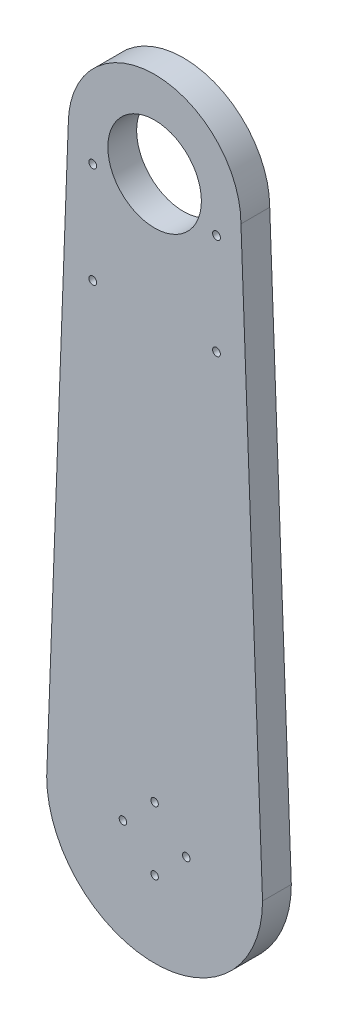
ISO-10303-21;
HEADER;
FILE_DESCRIPTION(('STEP AP214'),'2;1');
FILE_NAME('part.step','',(''),(''),'','','');
FILE_SCHEMA(('AUTOMOTIVE_DESIGN { 1 0 10303 214 1 1 1 1 }'));
ENDSEC;
DATA;
#1=APPLICATION_CONTEXT('core data for automotive mechanical design processes');
#2=APPLICATION_PROTOCOL_DEFINITION('international standard','automotive_design',2000,#1);
#3=PRODUCT_CONTEXT('',#1,'mechanical');
#4=PRODUCT('Part','Part','',(#3));
#5=PRODUCT_RELATED_PRODUCT_CATEGORY('part','',(#4));
#6=PRODUCT_DEFINITION_FORMATION('','',#4);
#7=PRODUCT_DEFINITION_CONTEXT('part definition',#1,'design');
#8=PRODUCT_DEFINITION('design','',#6,#7);
#9=PRODUCT_DEFINITION_SHAPE('','',#8);
#10=(LENGTH_UNIT() NAMED_UNIT(*) SI_UNIT(.MILLI.,.METRE.));
#11=(NAMED_UNIT(*) PLANE_ANGLE_UNIT() SI_UNIT($,.RADIAN.));
#12=(NAMED_UNIT(*) SI_UNIT($,.STERADIAN.) SOLID_ANGLE_UNIT());
#13=UNCERTAINTY_MEASURE_WITH_UNIT(LENGTH_MEASURE(1.E-05),#10,'distance_accuracy_value','');
#14=(GEOMETRIC_REPRESENTATION_CONTEXT(3) GLOBAL_UNCERTAINTY_ASSIGNED_CONTEXT((#13)) GLOBAL_UNIT_ASSIGNED_CONTEXT((#10,
#11,#12)) REPRESENTATION_CONTEXT('',''));
#15=CARTESIAN_POINT('',(0.,0.,0.));
#16=DIRECTION('',(0.,0.,1.));
#17=DIRECTION('',(1.,0.,0.));
#18=AXIS2_PLACEMENT_3D('',#15,#16,#17);
#19=CARTESIAN_POINT('',(37.447339678577,1.40427523794664,10.));
#20=DIRECTION('',(0.999297615709181,0.0374736605890943,0.));
#21=DIRECTION('',(-0.0374736605890943,0.999297615709181,0.));
#22=AXIS2_PLACEMENT_3D('',#19,#20,#21);
#23=PLANE('',#22);
#24=DIRECTION('',(0.0374736605890943,-0.999297615709181,0.));
#25=VECTOR('',#24,1.);
#26=CARTESIAN_POINT('',(37.447339678577,1.40427523794664,0.));
#27=LINE('',#26,#25);
#28=CARTESIAN_POINT('',(30.,200.,0.));
#29=VERTEX_POINT('',#28);
#30=CARTESIAN_POINT('',(37.5,0.,0.));
#31=VERTEX_POINT('',#30);
#32=EDGE_CURVE('E111',#29,#31,#27,.T.);
#33=ORIENTED_EDGE('',*,*,#32,.F.);
#34=DIRECTION('',(0.,0.,-1.));
#35=VECTOR('',#34,1.);
#36=CARTESIAN_POINT('',(30.,200.,10.));
#37=LINE('',#36,#35);
#38=CARTESIAN_POINT('',(30.,200.,10.));
#39=VERTEX_POINT('',#38);
#40=EDGE_CURVE('E11',#39,#29,#37,.T.);
#41=ORIENTED_EDGE('',*,*,#40,.F.);
#42=DIRECTION('',(0.0374736605890943,-0.999297615709181,0.));
#43=VECTOR('',#42,1.);
#44=CARTESIAN_POINT('',(37.447339678577,1.40427523794664,10.));
#45=LINE('',#44,#43);
#46=CARTESIAN_POINT('',(37.5,0.,10.));
#47=VERTEX_POINT('',#46);
#48=EDGE_CURVE('E95',#39,#47,#45,.T.);
#49=ORIENTED_EDGE('',*,*,#48,.T.);
#50=DIRECTION('',(0.,0.,-1.));
#51=VECTOR('',#50,1.);
#52=CARTESIAN_POINT('',(37.5,0.,10.));
#53=LINE('',#52,#51);
#54=EDGE_CURVE('E84',#47,#31,#53,.T.);
#55=ORIENTED_EDGE('',*,*,#54,.T.);
#56=EDGE_LOOP('',(#33,#41,#49,#55));
#57=FACE_BOUND('',#56,.T.);
#58=ADVANCED_FACE('F44',(#57),#23,.T.);
#59=CARTESIAN_POINT('',(0.,200.,10.));
#60=DIRECTION('',(0.,0.,-1.));
#61=DIRECTION('',(-1.,0.,0.));
#62=AXIS2_PLACEMENT_3D('',#59,#60,#61);
#63=CYLINDRICAL_SURFACE('',#62,30.);
#64=CARTESIAN_POINT('',(0.,200.,0.));
#65=DIRECTION('',(0.,0.,1.));
#66=DIRECTION('',(1.,0.,0.));
#67=AXIS2_PLACEMENT_3D('',#64,#65,#66);
#68=CIRCLE('',#67,30.);
#69=CARTESIAN_POINT('',(-30.,200.,0.));
#70=VERTEX_POINT('',#69);
#71=EDGE_CURVE('E101',#29,#70,#68,.T.);
#72=ORIENTED_EDGE('',*,*,#71,.T.);
#73=DIRECTION('',(0.,0.,-1.));
#74=VECTOR('',#73,1.);
#75=CARTESIAN_POINT('',(-30.,200.,10.));
#76=LINE('',#75,#74);
#77=CARTESIAN_POINT('',(-30.,200.,10.));
#78=VERTEX_POINT('',#77);
#79=EDGE_CURVE('E53',#78,#70,#76,.T.);
#80=ORIENTED_EDGE('',*,*,#79,.F.);
#81=CARTESIAN_POINT('',(0.,200.,10.));
#82=DIRECTION('',(0.,0.,1.));
#83=DIRECTION('',(1.,0.,0.));
#84=AXIS2_PLACEMENT_3D('',#81,#82,#83);
#85=CIRCLE('',#84,30.);
#86=EDGE_CURVE('E90',#39,#78,#85,.T.);
#87=ORIENTED_EDGE('',*,*,#86,.F.);
#88=ORIENTED_EDGE('',*,*,#40,.T.);
#89=EDGE_LOOP('',(#72,#80,#87,#88));
#90=FACE_BOUND('',#89,.T.);
#91=ADVANCED_FACE('F99',(#90),#63,.T.);
#92=CARTESIAN_POINT('',(-37.447339678577,1.40427523794664,10.));
#93=DIRECTION('',(0.999297615709181,-0.0374736605890943,0.));
#94=DIRECTION('',(0.0374736605890943,0.999297615709181,0.));
#95=AXIS2_PLACEMENT_3D('',#92,#93,#94);
#96=PLANE('',#95);
#97=DIRECTION('',(-0.0374736605890943,-0.999297615709181,0.));
#98=VECTOR('',#97,1.);
#99=CARTESIAN_POINT('',(-37.447339678577,1.40427523794664,0.));
#100=LINE('',#99,#98);
#101=CARTESIAN_POINT('',(-37.5,0.,0.));
#102=VERTEX_POINT('',#101);
#103=EDGE_CURVE('E77',#70,#102,#100,.T.);
#104=ORIENTED_EDGE('',*,*,#103,.T.);
#105=DIRECTION('',(0.,0.,-1.));
#106=VECTOR('',#105,1.);
#107=CARTESIAN_POINT('',(-37.5,0.,10.));
#108=LINE('',#107,#106);
#109=CARTESIAN_POINT('',(-37.5,0.,10.));
#110=VERTEX_POINT('',#109);
#111=EDGE_CURVE('E103',#110,#102,#108,.T.);
#112=ORIENTED_EDGE('',*,*,#111,.F.);
#113=DIRECTION('',(-0.0374736605890943,-0.999297615709181,0.));
#114=VECTOR('',#113,1.);
#115=CARTESIAN_POINT('',(-37.447339678577,1.40427523794664,10.));
#116=LINE('',#115,#114);
#117=EDGE_CURVE('E94',#78,#110,#116,.T.);
#118=ORIENTED_EDGE('',*,*,#117,.F.);
#119=ORIENTED_EDGE('',*,*,#79,.T.);
#120=EDGE_LOOP('',(#104,#112,#118,#119));
#121=FACE_BOUND('',#120,.T.);
#122=ADVANCED_FACE('F104',(#121),#96,.F.);
#123=CARTESIAN_POINT('',(0.,0.,10.));
#124=DIRECTION('',(0.,0.,-1.));
#125=DIRECTION('',(-1.,0.,0.));
#126=AXIS2_PLACEMENT_3D('',#123,#124,#125);
#127=CYLINDRICAL_SURFACE('',#126,37.5);
#128=CARTESIAN_POINT('',(0.,0.,0.));
#129=DIRECTION('',(0.,0.,1.));
#130=DIRECTION('',(1.,0.,0.));
#131=AXIS2_PLACEMENT_3D('',#128,#129,#130);
#132=CIRCLE('',#131,37.5);
#133=EDGE_CURVE('E120',#102,#31,#132,.T.);
#134=ORIENTED_EDGE('',*,*,#133,.T.);
#135=ORIENTED_EDGE('',*,*,#54,.F.);
#136=CARTESIAN_POINT('',(0.,0.,10.));
#137=DIRECTION('',(0.,0.,1.));
#138=DIRECTION('',(1.,0.,0.));
#139=AXIS2_PLACEMENT_3D('',#136,#137,#138);
#140=CIRCLE('',#139,37.5);
#141=EDGE_CURVE('E61',#110,#47,#140,.T.);
#142=ORIENTED_EDGE('',*,*,#141,.F.);
#143=ORIENTED_EDGE('',*,*,#111,.T.);
#144=EDGE_LOOP('',(#134,#135,#142,#143));
#145=FACE_BOUND('',#144,.T.);
#146=ADVANCED_FACE('F128',(#145),#127,.T.);
#147=CARTESIAN_POINT('',(0.,0.,10.));
#148=DIRECTION('',(0.,0.,1.));
#149=DIRECTION('',(1.,0.,0.));
#150=AXIS2_PLACEMENT_3D('',#147,#148,#149);
#151=PLANE('',#150);
#152=CARTESIAN_POINT('',(-21.5,157.25,10.));
#153=DIRECTION('',(0.,0.,1.));
#154=DIRECTION('',(1.,0.,0.));
#155=AXIS2_PLACEMENT_3D('',#152,#153,#154);
#156=CIRCLE('',#155,1.34999999999999);
#157=CARTESIAN_POINT('',(-20.15,157.25,10.));
#158=VERTEX_POINT('',#157);
#159=EDGE_CURVE('E207',#158,#158,#156,.F.);
#160=ORIENTED_EDGE('',*,*,#159,.T.);
#161=EDGE_LOOP('',(#160));
#162=FACE_BOUND('',#161,.T.);
#163=CARTESIAN_POINT('',(21.5,192.25,10.));
#164=DIRECTION('',(0.,0.,1.));
#165=DIRECTION('',(1.,0.,0.));
#166=AXIS2_PLACEMENT_3D('',#163,#164,#165);
#167=CIRCLE('',#166,1.35);
#168=CARTESIAN_POINT('',(22.85,192.25,10.));
#169=VERTEX_POINT('',#168);
#170=EDGE_CURVE('E199',#169,#169,#167,.F.);
#171=ORIENTED_EDGE('',*,*,#170,.T.);
#172=EDGE_LOOP('',(#171));
#173=FACE_BOUND('',#172,.T.);
#174=CARTESIAN_POINT('',(-21.5,192.25,10.));
#175=DIRECTION('',(0.,0.,1.));
#176=DIRECTION('',(1.,0.,0.));
#177=AXIS2_PLACEMENT_3D('',#174,#175,#176);
#178=CIRCLE('',#177,1.35);
#179=CARTESIAN_POINT('',(-20.15,192.25,10.));
#180=VERTEX_POINT('',#179);
#181=EDGE_CURVE('E191',#180,#180,#178,.F.);
#182=ORIENTED_EDGE('',*,*,#181,.T.);
#183=EDGE_LOOP('',(#182));
#184=FACE_BOUND('',#183,.T.);
#185=CARTESIAN_POINT('',(21.5,157.25,10.));
#186=DIRECTION('',(0.,0.,1.));
#187=DIRECTION('',(1.,0.,0.));
#188=AXIS2_PLACEMENT_3D('',#185,#186,#187);
#189=CIRCLE('',#188,1.35);
#190=CARTESIAN_POINT('',(22.85,157.25,10.));
#191=VERTEX_POINT('',#190);
#192=EDGE_CURVE('E218',#191,#191,#189,.F.);
#193=ORIENTED_EDGE('',*,*,#192,.T.);
#194=EDGE_LOOP('',(#193));
#195=FACE_BOUND('',#194,.T.);
#196=CARTESIAN_POINT('',(0.,11.,10.));
#197=DIRECTION('',(0.,0.,1.));
#198=DIRECTION('',(1.,0.,0.));
#199=AXIS2_PLACEMENT_3D('',#196,#197,#198);
#200=CIRCLE('',#199,1.3);
#201=CARTESIAN_POINT('',(1.3,11.,10.));
#202=VERTEX_POINT('',#201);
#203=EDGE_CURVE('E228',#202,#202,#200,.F.);
#204=ORIENTED_EDGE('',*,*,#203,.T.);
#205=EDGE_LOOP('',(#204));
#206=FACE_BOUND('',#205,.T.);
#207=CARTESIAN_POINT('',(-11.,0.,10.));
#208=DIRECTION('',(0.,0.,1.));
#209=DIRECTION('',(1.,0.,0.));
#210=AXIS2_PLACEMENT_3D('',#207,#208,#209);
#211=CIRCLE('',#210,1.30000000000004);
#212=CARTESIAN_POINT('',(-9.69999999999996,0.,10.));
#213=VERTEX_POINT('',#212);
#214=EDGE_CURVE('E236',#213,#213,#211,.F.);
#215=ORIENTED_EDGE('',*,*,#214,.T.);
#216=EDGE_LOOP('',(#215));
#217=FACE_BOUND('',#216,.T.);
#218=CARTESIAN_POINT('',(0.,-11.,10.));
#219=DIRECTION('',(0.,0.,1.));
#220=DIRECTION('',(1.,0.,0.));
#221=AXIS2_PLACEMENT_3D('',#218,#219,#220);
#222=CIRCLE('',#221,1.30000000000007);
#223=CARTESIAN_POINT('',(1.30000000000007,-11.,10.));
#224=VERTEX_POINT('',#223);
#225=EDGE_CURVE('E244',#224,#224,#222,.F.);
#226=ORIENTED_EDGE('',*,*,#225,.T.);
#227=EDGE_LOOP('',(#226));
#228=FACE_BOUND('',#227,.T.);
#229=CARTESIAN_POINT('',(11.,0.,10.));
#230=DIRECTION('',(0.,0.,1.));
#231=DIRECTION('',(1.,0.,0.));
#232=AXIS2_PLACEMENT_3D('',#229,#230,#231);
#233=CIRCLE('',#232,1.30000000000011);
#234=CARTESIAN_POINT('',(12.3000000000001,0.,10.));
#235=VERTEX_POINT('',#234);
#236=EDGE_CURVE('E222',#235,#235,#233,.F.);
#237=ORIENTED_EDGE('',*,*,#236,.T.);
#238=EDGE_LOOP('',(#237));
#239=FACE_BOUND('',#238,.T.);
#240=CARTESIAN_POINT('',(0.,200.,10.));
#241=DIRECTION('',(0.,0.,1.));
#242=DIRECTION('',(1.,0.,0.));
#243=AXIS2_PLACEMENT_3D('',#240,#241,#242);
#244=CIRCLE('',#243,16.25);
#245=CARTESIAN_POINT('',(16.25,200.,10.));
#246=VERTEX_POINT('',#245);
#247=EDGE_CURVE('E227',#246,#246,#244,.F.);
#248=ORIENTED_EDGE('',*,*,#247,.T.);
#249=EDGE_LOOP('',(#248));
#250=FACE_BOUND('',#249,.T.);
#251=ORIENTED_EDGE('',*,*,#48,.F.);
#252=ORIENTED_EDGE('',*,*,#86,.T.);
#253=ORIENTED_EDGE('',*,*,#117,.T.);
#254=ORIENTED_EDGE('',*,*,#141,.T.);
#255=EDGE_LOOP('',(#251,#252,#253,#254));
#256=FACE_BOUND('',#255,.T.);
#257=ADVANCED_FACE('F92',(#162,#173,#184,#195,#206,#217,#228,#239,#250,#256),#151,.T.);
#258=CARTESIAN_POINT('',(0.,0.,0.));
#259=DIRECTION('',(0.,0.,1.));
#260=DIRECTION('',(1.,0.,0.));
#261=AXIS2_PLACEMENT_3D('',#258,#259,#260);
#262=PLANE('',#261);
#263=CARTESIAN_POINT('',(-21.5,157.25,0.));
#264=DIRECTION('',(0.,0.,-1.));
#265=DIRECTION('',(-1.,0.,0.));
#266=AXIS2_PLACEMENT_3D('',#263,#264,#265);
#267=CIRCLE('',#266,1.34999999999999);
#268=CARTESIAN_POINT('',(-22.85,157.25,0.));
#269=VERTEX_POINT('',#268);
#270=EDGE_CURVE('E203',#269,#269,#267,.T.);
#271=ORIENTED_EDGE('',*,*,#270,.F.);
#272=EDGE_LOOP('',(#271));
#273=FACE_BOUND('',#272,.T.);
#274=CARTESIAN_POINT('',(21.5,192.25,0.));
#275=DIRECTION('',(0.,0.,-1.));
#276=DIRECTION('',(-1.,0.,0.));
#277=AXIS2_PLACEMENT_3D('',#274,#275,#276);
#278=CIRCLE('',#277,1.35);
#279=CARTESIAN_POINT('',(20.15,192.25,0.));
#280=VERTEX_POINT('',#279);
#281=EDGE_CURVE('E194',#280,#280,#278,.T.);
#282=ORIENTED_EDGE('',*,*,#281,.F.);
#283=EDGE_LOOP('',(#282));
#284=FACE_BOUND('',#283,.T.);
#285=CARTESIAN_POINT('',(-21.5,192.25,0.));
#286=DIRECTION('',(0.,0.,-1.));
#287=DIRECTION('',(-1.,0.,0.));
#288=AXIS2_PLACEMENT_3D('',#285,#286,#287);
#289=CIRCLE('',#288,1.35);
#290=CARTESIAN_POINT('',(-22.85,192.25,0.));
#291=VERTEX_POINT('',#290);
#292=EDGE_CURVE('E188',#291,#291,#289,.T.);
#293=ORIENTED_EDGE('',*,*,#292,.F.);
#294=EDGE_LOOP('',(#293));
#295=FACE_BOUND('',#294,.T.);
#296=CARTESIAN_POINT('',(21.5,157.25,0.));
#297=DIRECTION('',(0.,0.,-1.));
#298=DIRECTION('',(-1.,0.,0.));
#299=AXIS2_PLACEMENT_3D('',#296,#297,#298);
#300=CIRCLE('',#299,1.35);
#301=CARTESIAN_POINT('',(20.15,157.25,0.));
#302=VERTEX_POINT('',#301);
#303=EDGE_CURVE('E210',#302,#302,#300,.T.);
#304=ORIENTED_EDGE('',*,*,#303,.F.);
#305=EDGE_LOOP('',(#304));
#306=FACE_BOUND('',#305,.T.);
#307=CARTESIAN_POINT('',(0.,11.,0.));
#308=DIRECTION('',(0.,0.,-1.));
#309=DIRECTION('',(-1.,0.,0.));
#310=AXIS2_PLACEMENT_3D('',#307,#308,#309);
#311=CIRCLE('',#310,1.3);
#312=CARTESIAN_POINT('',(-1.3,11.,0.));
#313=VERTEX_POINT('',#312);
#314=EDGE_CURVE('E223',#313,#313,#311,.T.);
#315=ORIENTED_EDGE('',*,*,#314,.F.);
#316=EDGE_LOOP('',(#315));
#317=FACE_BOUND('',#316,.T.);
#318=CARTESIAN_POINT('',(-11.,0.,0.));
#319=DIRECTION('',(0.,0.,-1.));
#320=DIRECTION('',(-1.,0.,0.));
#321=AXIS2_PLACEMENT_3D('',#318,#319,#320);
#322=CIRCLE('',#321,1.30000000000004);
#323=CARTESIAN_POINT('',(-12.3,0.,0.));
#324=VERTEX_POINT('',#323);
#325=EDGE_CURVE('E232',#324,#324,#322,.T.);
#326=ORIENTED_EDGE('',*,*,#325,.F.);
#327=EDGE_LOOP('',(#326));
#328=FACE_BOUND('',#327,.T.);
#329=CARTESIAN_POINT('',(0.,-11.,0.));
#330=DIRECTION('',(0.,0.,-1.));
#331=DIRECTION('',(-1.,0.,0.));
#332=AXIS2_PLACEMENT_3D('',#329,#330,#331);
#333=CIRCLE('',#332,1.30000000000007);
#334=CARTESIAN_POINT('',(-1.30000000000008,-11.,0.));
#335=VERTEX_POINT('',#334);
#336=EDGE_CURVE('E240',#335,#335,#333,.T.);
#337=ORIENTED_EDGE('',*,*,#336,.F.);
#338=EDGE_LOOP('',(#337));
#339=FACE_BOUND('',#338,.T.);
#340=CARTESIAN_POINT('',(11.,0.,0.));
#341=DIRECTION('',(0.,0.,-1.));
#342=DIRECTION('',(-1.,0.,0.));
#343=AXIS2_PLACEMENT_3D('',#340,#341,#342);
#344=CIRCLE('',#343,1.30000000000011);
#345=CARTESIAN_POINT('',(9.69999999999989,0.,0.));
#346=VERTEX_POINT('',#345);
#347=EDGE_CURVE('E248',#346,#346,#344,.T.);
#348=ORIENTED_EDGE('',*,*,#347,.F.);
#349=EDGE_LOOP('',(#348));
#350=FACE_BOUND('',#349,.T.);
#351=CARTESIAN_POINT('',(0.,200.,0.));
#352=DIRECTION('',(0.,0.,-1.));
#353=DIRECTION('',(-1.,0.,0.));
#354=AXIS2_PLACEMENT_3D('',#351,#352,#353);
#355=CIRCLE('',#354,16.25);
#356=CARTESIAN_POINT('',(-16.25,200.,0.));
#357=VERTEX_POINT('',#356);
#358=EDGE_CURVE('E115',#357,#357,#355,.T.);
#359=ORIENTED_EDGE('',*,*,#358,.F.);
#360=EDGE_LOOP('',(#359));
#361=FACE_BOUND('',#360,.T.);
#362=ORIENTED_EDGE('',*,*,#32,.T.);
#363=ORIENTED_EDGE('',*,*,#133,.F.);
#364=ORIENTED_EDGE('',*,*,#103,.F.);
#365=ORIENTED_EDGE('',*,*,#71,.F.);
#366=EDGE_LOOP('',(#362,#363,#364,#365));
#367=FACE_BOUND('',#366,.T.);
#368=ADVANCED_FACE('F130',(#273,#284,#295,#306,#317,#328,#339,#350,#361,#367),#262,.F.);
#369=CARTESIAN_POINT('',(0.,200.,10.001));
#370=DIRECTION('',(0.,0.,-1.));
#371=DIRECTION('',(-1.,0.,0.));
#372=AXIS2_PLACEMENT_3D('',#369,#370,#371);
#373=CYLINDRICAL_SURFACE('',#372,16.25);
#374=ORIENTED_EDGE('',*,*,#247,.F.);
#375=EDGE_LOOP('',(#374));
#376=FACE_BOUND('',#375,.T.);
#377=ORIENTED_EDGE('',*,*,#358,.T.);
#378=EDGE_LOOP('',(#377));
#379=FACE_BOUND('',#378,.T.);
#380=ADVANCED_FACE('F144',(#376,#379),#373,.F.);
#381=CARTESIAN_POINT('',(11.,0.,10.001));
#382=DIRECTION('',(0.,0.,-1.));
#383=DIRECTION('',(-1.,0.,0.));
#384=AXIS2_PLACEMENT_3D('',#381,#382,#383);
#385=CYLINDRICAL_SURFACE('',#384,1.30000000000011);
#386=ORIENTED_EDGE('',*,*,#236,.F.);
#387=EDGE_LOOP('',(#386));
#388=FACE_BOUND('',#387,.T.);
#389=ORIENTED_EDGE('',*,*,#347,.T.);
#390=EDGE_LOOP('',(#389));
#391=FACE_BOUND('',#390,.T.);
#392=ADVANCED_FACE('F151',(#388,#391),#385,.F.);
#393=CARTESIAN_POINT('',(0.,-11.,10.001));
#394=DIRECTION('',(0.,0.,-1.));
#395=DIRECTION('',(-1.,0.,0.));
#396=AXIS2_PLACEMENT_3D('',#393,#394,#395);
#397=CYLINDRICAL_SURFACE('',#396,1.30000000000007);
#398=ORIENTED_EDGE('',*,*,#225,.F.);
#399=EDGE_LOOP('',(#398));
#400=FACE_BOUND('',#399,.T.);
#401=ORIENTED_EDGE('',*,*,#336,.T.);
#402=EDGE_LOOP('',(#401));
#403=FACE_BOUND('',#402,.T.);
#404=ADVANCED_FACE('F155',(#400,#403),#397,.F.);
#405=CARTESIAN_POINT('',(-11.,0.,10.001));
#406=DIRECTION('',(0.,0.,-1.));
#407=DIRECTION('',(-1.,0.,0.));
#408=AXIS2_PLACEMENT_3D('',#405,#406,#407);
#409=CYLINDRICAL_SURFACE('',#408,1.30000000000004);
#410=ORIENTED_EDGE('',*,*,#214,.F.);
#411=EDGE_LOOP('',(#410));
#412=FACE_BOUND('',#411,.T.);
#413=ORIENTED_EDGE('',*,*,#325,.T.);
#414=EDGE_LOOP('',(#413));
#415=FACE_BOUND('',#414,.T.);
#416=ADVANCED_FACE('F159',(#412,#415),#409,.F.);
#417=CARTESIAN_POINT('',(0.,11.,10.001));
#418=DIRECTION('',(0.,0.,-1.));
#419=DIRECTION('',(-1.,0.,0.));
#420=AXIS2_PLACEMENT_3D('',#417,#418,#419);
#421=CYLINDRICAL_SURFACE('',#420,1.3);
#422=ORIENTED_EDGE('',*,*,#203,.F.);
#423=EDGE_LOOP('',(#422));
#424=FACE_BOUND('',#423,.T.);
#425=ORIENTED_EDGE('',*,*,#314,.T.);
#426=EDGE_LOOP('',(#425));
#427=FACE_BOUND('',#426,.T.);
#428=ADVANCED_FACE('F163',(#424,#427),#421,.F.);
#429=CARTESIAN_POINT('',(21.5,157.25,13.8183766184073));
#430=DIRECTION('',(0.,0.,-1.));
#431=DIRECTION('',(-1.,0.,0.));
#432=AXIS2_PLACEMENT_3D('',#429,#430,#431);
#433=CYLINDRICAL_SURFACE('',#432,1.35);
#434=ORIENTED_EDGE('',*,*,#303,.T.);
#435=EDGE_LOOP('',(#434));
#436=FACE_BOUND('',#435,.T.);
#437=ORIENTED_EDGE('',*,*,#192,.F.);
#438=EDGE_LOOP('',(#437));
#439=FACE_BOUND('',#438,.T.);
#440=ADVANCED_FACE('F167',(#436,#439),#433,.F.);
#441=CARTESIAN_POINT('',(-21.5,192.25,13.8183766184073));
#442=DIRECTION('',(0.,0.,-1.));
#443=DIRECTION('',(-1.,0.,0.));
#444=AXIS2_PLACEMENT_3D('',#441,#442,#443);
#445=CYLINDRICAL_SURFACE('',#444,1.35);
#446=ORIENTED_EDGE('',*,*,#292,.T.);
#447=EDGE_LOOP('',(#446));
#448=FACE_BOUND('',#447,.T.);
#449=ORIENTED_EDGE('',*,*,#181,.F.);
#450=EDGE_LOOP('',(#449));
#451=FACE_BOUND('',#450,.T.);
#452=ADVANCED_FACE('F171',(#448,#451),#445,.F.);
#453=CARTESIAN_POINT('',(21.5,192.25,13.8183766184073));
#454=DIRECTION('',(0.,0.,-1.));
#455=DIRECTION('',(-1.,0.,0.));
#456=AXIS2_PLACEMENT_3D('',#453,#454,#455);
#457=CYLINDRICAL_SURFACE('',#456,1.35);
#458=ORIENTED_EDGE('',*,*,#281,.T.);
#459=EDGE_LOOP('',(#458));
#460=FACE_BOUND('',#459,.T.);
#461=ORIENTED_EDGE('',*,*,#170,.F.);
#462=EDGE_LOOP('',(#461));
#463=FACE_BOUND('',#462,.T.);
#464=ADVANCED_FACE('F173',(#460,#463),#457,.F.);
#465=CARTESIAN_POINT('',(-21.5,157.25,13.8183766184073));
#466=DIRECTION('',(0.,0.,-1.));
#467=DIRECTION('',(-1.,0.,0.));
#468=AXIS2_PLACEMENT_3D('',#465,#466,#467);
#469=CYLINDRICAL_SURFACE('',#468,1.34999999999999);
#470=ORIENTED_EDGE('',*,*,#270,.T.);
#471=EDGE_LOOP('',(#470));
#472=FACE_BOUND('',#471,.T.);
#473=ORIENTED_EDGE('',*,*,#159,.F.);
#474=EDGE_LOOP('',(#473));
#475=FACE_BOUND('',#474,.T.);
#476=ADVANCED_FACE('F176',(#472,#475),#469,.F.);
#477=CLOSED_SHELL('',(#58,#91,#122,#146,#257,#368,#380,#392,#404,#416,#428,#440,#452,#464,#476));
#478=MANIFOLD_SOLID_BREP('B2',#477);
#479=ADVANCED_BREP_SHAPE_REPRESENTATION('',(#18,#478),#14);
#480=SHAPE_DEFINITION_REPRESENTATION(#9,#479);
ENDSEC;
END-ISO-10303-21;
